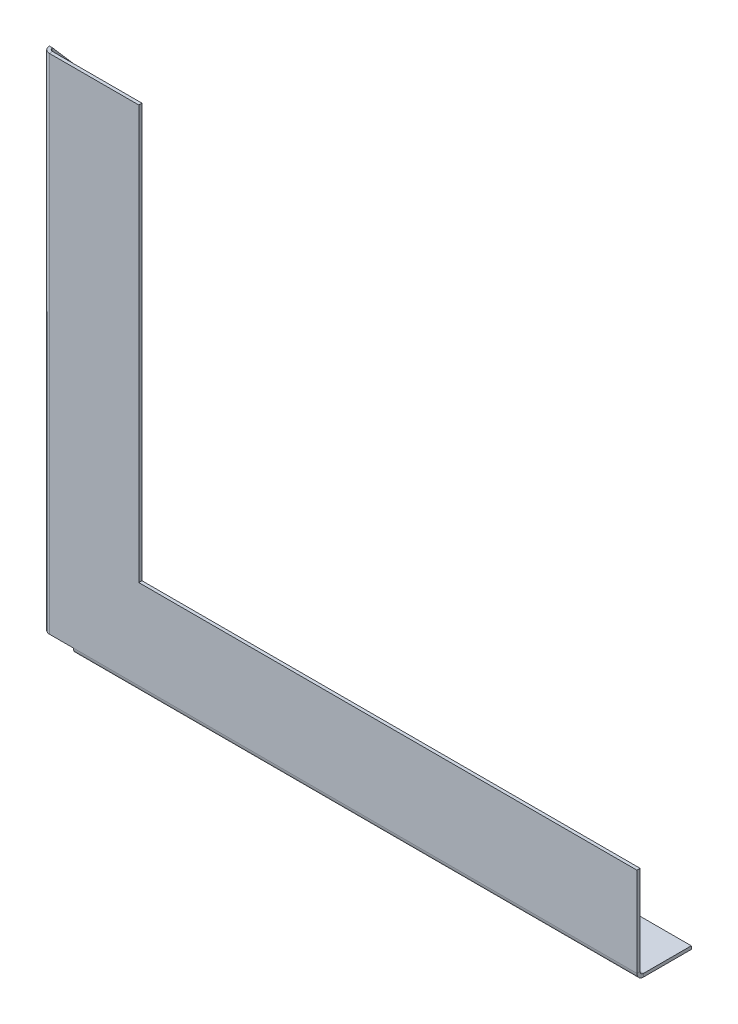
ISO-10303-21;
HEADER;
FILE_DESCRIPTION(('STEP AP214'),'2;1');
FILE_NAME('part.step','',(''),(''),'','','');
FILE_SCHEMA(('AUTOMOTIVE_DESIGN { 1 0 10303 214 1 1 1 1 }'));
ENDSEC;
DATA;
#1=APPLICATION_CONTEXT('core data for automotive mechanical design processes');
#2=APPLICATION_PROTOCOL_DEFINITION('international standard','automotive_design',2000,#1);
#3=PRODUCT_CONTEXT('',#1,'mechanical');
#4=PRODUCT('Part','Part','',(#3));
#5=PRODUCT_RELATED_PRODUCT_CATEGORY('part','',(#4));
#6=PRODUCT_DEFINITION_FORMATION('','',#4);
#7=PRODUCT_DEFINITION_CONTEXT('part definition',#1,'design');
#8=PRODUCT_DEFINITION('design','',#6,#7);
#9=PRODUCT_DEFINITION_SHAPE('','',#8);
#10=(LENGTH_UNIT() NAMED_UNIT(*) SI_UNIT(.MILLI.,.METRE.));
#11=(NAMED_UNIT(*) PLANE_ANGLE_UNIT() SI_UNIT($,.RADIAN.));
#12=(NAMED_UNIT(*) SI_UNIT($,.STERADIAN.) SOLID_ANGLE_UNIT());
#13=UNCERTAINTY_MEASURE_WITH_UNIT(LENGTH_MEASURE(1.E-05),#10,'distance_accuracy_value','');
#14=(GEOMETRIC_REPRESENTATION_CONTEXT(3) GLOBAL_UNCERTAINTY_ASSIGNED_CONTEXT((#13)) GLOBAL_UNIT_ASSIGNED_CONTEXT((#10,
#11,#12)) REPRESENTATION_CONTEXT('',''));
#15=CARTESIAN_POINT('',(0.,0.,0.));
#16=DIRECTION('',(0.,0.,1.));
#17=DIRECTION('',(1.,0.,0.));
#18=AXIS2_PLACEMENT_3D('',#15,#16,#17);
#19=CARTESIAN_POINT('',(-114.828433550695,43.3205731721392,2.));
#20=DIRECTION('',(0.,0.,-1.));
#21=DIRECTION('',(-1.,0.,0.));
#22=AXIS2_PLACEMENT_3D('',#19,#20,#21);
#23=PLANE('',#22);
#24=DIRECTION('',(0.,-1.,0.));
#25=VECTOR('',#24,1.);
#26=CARTESIAN_POINT('',(257.171566450635,-215.679426827861,2.));
#27=LINE('',#26,#25);
#28=CARTESIAN_POINT('',(257.171566450635,-215.679426827861,2.));
#29=VERTEX_POINT('',#28);
#30=CARTESIAN_POINT('',(257.171566449848,-271.679426685231,2.0000000950868));
#31=VERTEX_POINT('',#30);
#32=EDGE_CURVE('E283',#29,#31,#27,.T.);
#33=ORIENTED_EDGE('',*,*,#32,.F.);
#34=DIRECTION('',(-1.,0.,0.));
#35=VECTOR('',#34,1.);
#36=CARTESIAN_POINT('',(-54.8284335506954,-215.679426827861,2.));
#37=LINE('',#36,#35);
#38=CARTESIAN_POINT('',(-54.8284335506954,-215.679426827861,2.));
#39=VERTEX_POINT('',#38);
#40=EDGE_CURVE('E324',#29,#39,#37,.T.);
#41=ORIENTED_EDGE('',*,*,#40,.T.);
#42=DIRECTION('',(0.,1.,0.));
#43=VECTOR('',#42,1.);
#44=CARTESIAN_POINT('',(-54.8284335506954,43.3205731721392,2.));
#45=LINE('',#44,#43);
#46=CARTESIAN_POINT('',(-54.8284335506954,43.3205731721392,2.));
#47=VERTEX_POINT('',#46);
#48=EDGE_CURVE('E326',#39,#47,#45,.T.);
#49=ORIENTED_EDGE('',*,*,#48,.T.);
#50=DIRECTION('',(-1.,0.,0.));
#51=VECTOR('',#50,1.);
#52=CARTESIAN_POINT('',(-114.828433550695,43.3205731721392,2.));
#53=LINE('',#52,#51);
#54=CARTESIAN_POINT('',(-110.828433550695,43.3205731721392,2.00000000000001));
#55=VERTEX_POINT('',#54);
#56=EDGE_CURVE('E329',#47,#55,#53,.T.);
#57=ORIENTED_EDGE('',*,*,#56,.T.);
#58=DIRECTION('',(0.,-1.,0.));
#59=VECTOR('',#58,1.);
#60=CARTESIAN_POINT('',(-110.828433550695,43.3205731721392,2.00000000000001));
#61=LINE('',#60,#59);
#62=CARTESIAN_POINT('',(-110.828433550695,-271.679426685231,2.00000007757914));
#63=VERTEX_POINT('',#62);
#64=EDGE_CURVE('E343',#55,#63,#61,.T.);
#65=ORIENTED_EDGE('',*,*,#64,.T.);
#66=DIRECTION('',(1.,0.,0.));
#67=VECTOR('',#66,1.);
#68=CARTESIAN_POINT('',(-110.828433550695,-271.679426827861,1.99999999999994));
#69=LINE('',#68,#67);
#70=CARTESIAN_POINT('',(-95.8284335486283,-271.679426685231,2.00000019017365));
#71=VERTEX_POINT('',#70);
#72=EDGE_CURVE('E341',#63,#71,#69,.T.);
#73=ORIENTED_EDGE('',*,*,#72,.T.);
#74=DIRECTION('',(1.,0.,0.));
#75=VECTOR('',#74,1.);
#76=CARTESIAN_POINT('',(-110.828433550695,-271.679426827861,1.99999999999994));
#77=LINE('',#76,#75);
#78=EDGE_CURVE('E357',#71,#31,#77,.T.);
#79=ORIENTED_EDGE('',*,*,#78,.T.);
#80=EDGE_LOOP('',(#33,#41,#49,#57,#65,#73,#79));
#81=FACE_BOUND('',#80,.T.);
#82=ADVANCED_FACE('F84',(#81),#23,.F.);
#83=CARTESIAN_POINT('',(-114.828433550695,43.3205731721392,0.));
#84=DIRECTION('',(0.,0.,-1.));
#85=DIRECTION('',(-1.,0.,0.));
#86=AXIS2_PLACEMENT_3D('',#83,#84,#85);
#87=PLANE('',#86);
#88=DIRECTION('',(-1.,0.,0.));
#89=VECTOR('',#88,1.);
#90=CARTESIAN_POINT('',(-54.8284335506954,-215.679426827861,0.));
#91=LINE('',#90,#89);
#92=CARTESIAN_POINT('',(257.171566450635,-215.679426827861,0.));
#93=VERTEX_POINT('',#92);
#94=CARTESIAN_POINT('',(-54.8284335506954,-215.679426827861,0.));
#95=VERTEX_POINT('',#94);
#96=EDGE_CURVE('E323',#93,#95,#91,.T.);
#97=ORIENTED_EDGE('',*,*,#96,.F.);
#98=DIRECTION('',(0.,1.,0.));
#99=VECTOR('',#98,1.);
#100=CARTESIAN_POINT('',(257.171566450635,43.3205731721392,0.));
#101=LINE('',#100,#99);
#102=CARTESIAN_POINT('',(257.171566450635,-271.679426827861,0.));
#103=VERTEX_POINT('',#102);
#104=EDGE_CURVE('E310',#93,#103,#101,.F.);
#105=ORIENTED_EDGE('',*,*,#104,.T.);
#106=DIRECTION('',(1.,0.,0.));
#107=VECTOR('',#106,1.);
#108=CARTESIAN_POINT('',(-110.828433550695,-271.679426827861,0.));
#109=LINE('',#108,#107);
#110=CARTESIAN_POINT('',(-95.8284335486283,-271.679426756546,1.90173646361785E-07));
#111=VERTEX_POINT('',#110);
#112=EDGE_CURVE('E92',#111,#103,#109,.T.);
#113=ORIENTED_EDGE('',*,*,#112,.F.);
#114=DIRECTION('',(1.,0.,0.));
#115=VECTOR('',#114,1.);
#116=CARTESIAN_POINT('',(-110.828433550695,-271.679426827861,0.));
#117=LINE('',#116,#115);
#118=CARTESIAN_POINT('',(-110.828433548628,-271.679426685231,1.90173640723934E-07));
#119=VERTEX_POINT('',#118);
#120=EDGE_CURVE('E107',#119,#111,#117,.T.);
#121=ORIENTED_EDGE('',*,*,#120,.F.);
#122=DIRECTION('',(0.,-1.,0.));
#123=VECTOR('',#122,1.);
#124=CARTESIAN_POINT('',(-110.828433550695,43.3205731721392,0.));
#125=LINE('',#124,#123);
#126=CARTESIAN_POINT('',(-110.828433550695,43.3205731721392,0.));
#127=VERTEX_POINT('',#126);
#128=EDGE_CURVE('E351',#127,#119,#125,.T.);
#129=ORIENTED_EDGE('',*,*,#128,.F.);
#130=DIRECTION('',(-1.,0.,0.));
#131=VECTOR('',#130,1.);
#132=CARTESIAN_POINT('',(-114.828433550695,43.3205731721392,0.));
#133=LINE('',#132,#131);
#134=CARTESIAN_POINT('',(-54.8284335506954,43.3205731721392,0.));
#135=VERTEX_POINT('',#134);
#136=EDGE_CURVE('E327',#135,#127,#133,.T.);
#137=ORIENTED_EDGE('',*,*,#136,.F.);
#138=DIRECTION('',(0.,1.,0.));
#139=VECTOR('',#138,1.);
#140=CARTESIAN_POINT('',(-54.8284335506954,43.3205731721392,0.));
#141=LINE('',#140,#139);
#142=EDGE_CURVE('E333',#95,#135,#141,.T.);
#143=ORIENTED_EDGE('',*,*,#142,.F.);
#144=EDGE_LOOP('',(#97,#105,#113,#121,#129,#137,#143));
#145=FACE_BOUND('',#144,.T.);
#146=ADVANCED_FACE('F366',(#145),#87,.T.);
#147=CARTESIAN_POINT('',(-54.8284335506954,-215.679426827861,2.));
#148=DIRECTION('',(0.,-1.,0.));
#149=DIRECTION('',(1.,0.,0.));
#150=AXIS2_PLACEMENT_3D('',#147,#148,#149);
#151=PLANE('',#150);
#152=DIRECTION('',(0.,0.,1.));
#153=VECTOR('',#152,1.);
#154=CARTESIAN_POINT('',(257.171566450635,-215.679426827861,2.));
#155=LINE('',#154,#153);
#156=EDGE_CURVE('E318',#29,#93,#155,.F.);
#157=ORIENTED_EDGE('',*,*,#156,.T.);
#158=ORIENTED_EDGE('',*,*,#96,.T.);
#159=DIRECTION('',(0.,0.,-1.));
#160=VECTOR('',#159,1.);
#161=CARTESIAN_POINT('',(-54.8284335506954,-215.679426827861,2.));
#162=LINE('',#161,#160);
#163=EDGE_CURVE('E338',#39,#95,#162,.T.);
#164=ORIENTED_EDGE('',*,*,#163,.F.);
#165=ORIENTED_EDGE('',*,*,#40,.F.);
#166=EDGE_LOOP('',(#157,#158,#164,#165));
#167=FACE_BOUND('',#166,.T.);
#168=ADVANCED_FACE('F405',(#167),#151,.F.);
#169=CARTESIAN_POINT('',(-114.828433550695,43.3205731721392,2.));
#170=DIRECTION('',(0.,-1.,0.));
#171=DIRECTION('',(0.,0.,-1.));
#172=AXIS2_PLACEMENT_3D('',#169,#170,#171);
#173=PLANE('',#172);
#174=DIRECTION('',(0.,0.,1.));
#175=VECTOR('',#174,1.);
#176=CARTESIAN_POINT('',(-110.828433550695,43.3205731721392,0.));
#177=LINE('',#176,#175);
#178=EDGE_CURVE('E348',#127,#55,#177,.T.);
#179=ORIENTED_EDGE('',*,*,#178,.T.);
#180=ORIENTED_EDGE('',*,*,#56,.F.);
#181=DIRECTION('',(0.,0.,-1.));
#182=VECTOR('',#181,1.);
#183=CARTESIAN_POINT('',(-54.8284335506954,43.3205731721392,2.));
#184=LINE('',#183,#182);
#185=EDGE_CURVE('E331',#47,#135,#184,.T.);
#186=ORIENTED_EDGE('',*,*,#185,.T.);
#187=ORIENTED_EDGE('',*,*,#136,.T.);
#188=EDGE_LOOP('',(#179,#180,#186,#187));
#189=FACE_BOUND('',#188,.T.);
#190=ADVANCED_FACE('F409',(#189),#173,.F.);
#191=CARTESIAN_POINT('',(-54.8284335506954,43.3205731721392,2.));
#192=DIRECTION('',(-1.,0.,0.));
#193=DIRECTION('',(0.,-1.,0.));
#194=AXIS2_PLACEMENT_3D('',#191,#192,#193);
#195=PLANE('',#194);
#196=ORIENTED_EDGE('',*,*,#142,.T.);
#197=ORIENTED_EDGE('',*,*,#185,.F.);
#198=ORIENTED_EDGE('',*,*,#48,.F.);
#199=ORIENTED_EDGE('',*,*,#163,.T.);
#200=EDGE_LOOP('',(#196,#197,#198,#199));
#201=FACE_BOUND('',#200,.T.);
#202=ADVANCED_FACE('F412',(#201),#195,.F.);
#203=CARTESIAN_POINT('',(257.171566450635,-215.679426827861,2.));
#204=DIRECTION('',(1.,0.,0.));
#205=DIRECTION('',(0.,-1.,0.));
#206=AXIS2_PLACEMENT_3D('',#203,#204,#205);
#207=PLANE('',#206);
#208=ORIENTED_EDGE('',*,*,#32,.T.);
#209=DIRECTION('',(0.,0.,-1.));
#210=VECTOR('',#209,1.);
#211=CARTESIAN_POINT('',(257.171566450635,-271.679426827861,2.));
#212=LINE('',#211,#210);
#213=EDGE_CURVE('E13',#31,#103,#212,.T.);
#214=ORIENTED_EDGE('',*,*,#213,.T.);
#215=ORIENTED_EDGE('',*,*,#104,.F.);
#216=ORIENTED_EDGE('',*,*,#156,.F.);
#217=EDGE_LOOP('',(#208,#214,#215,#216));
#218=FACE_BOUND('',#217,.T.);
#219=ADVANCED_FACE('F369',(#218),#207,.T.);
#220=CARTESIAN_POINT('',(-110.828433550695,-271.679426827861,-2.00000007757913));
#221=DIRECTION('',(0.,-1.,0.));
#222=DIRECTION('',(0.,0.,-1.));
#223=AXIS2_PLACEMENT_3D('',#220,#221,#222);
#224=PLANE('',#223);
#225=DIRECTION('',(0.,0.,1.));
#226=VECTOR('',#225,1.);
#227=CARTESIAN_POINT('',(-110.828433548628,-271.679426685231,1.90173640723934E-07));
#228=LINE('',#227,#226);
#229=EDGE_CURVE('E354',#119,#63,#228,.T.);
#230=ORIENTED_EDGE('',*,*,#229,.F.);
#231=ORIENTED_EDGE('',*,*,#120,.T.);
#232=DIRECTION('',(0.,0.,1.));
#233=VECTOR('',#232,1.);
#234=CARTESIAN_POINT('',(-95.8284335486283,-271.679426685231,-32.0000001426302));
#235=LINE('',#234,#233);
#236=EDGE_CURVE('E360',#111,#71,#235,.T.);
#237=ORIENTED_EDGE('',*,*,#236,.T.);
#238=ORIENTED_EDGE('',*,*,#72,.F.);
#239=EDGE_LOOP('',(#230,#231,#237,#238));
#240=FACE_BOUND('',#239,.T.);
#241=ADVANCED_FACE('F86',(#240),#224,.T.);
#242=CARTESIAN_POINT('',(-110.828433550695,43.3205731721392,-2.00000007757913));
#243=DIRECTION('',(1.18077146293835E-10,1.,0.));
#244=DIRECTION('',(-1.,1.18077146293835E-10,0.));
#245=AXIS2_PLACEMENT_3D('',#242,#243,#244);
#246=PLANE('',#245);
#247=ORIENTED_EDGE('',*,*,#178,.F.);
#248=CARTESIAN_POINT('',(-110.828433550695,43.3205731721392,-2.00000007757913));
#249=DIRECTION('',(-1.18077146293835E-10,-1.,0.));
#250=DIRECTION('',(1.,-1.18077146293835E-10,0.));
#251=AXIS2_PLACEMENT_3D('',#248,#249,#250);
#252=CIRCLE('',#251,2.00000007757913);
#253=CARTESIAN_POINT('',(-112.828433434327,43.320573172878,-2.00000011636872));
#254=VERTEX_POINT('',#253);
#255=EDGE_CURVE('E243',#127,#254,#252,.T.);
#256=ORIENTED_EDGE('',*,*,#255,.T.);
#257=DIRECTION('',(-1.,0.,0.));
#258=VECTOR('',#257,1.);
#259=CARTESIAN_POINT('',(-112.828433434327,43.320573172878,-2.00000011636872));
#260=LINE('',#259,#258);
#261=CARTESIAN_POINT('',(-114.828433434327,43.320573172878,-2.00000011636872));
#262=VERTEX_POINT('',#261);
#263=EDGE_CURVE('E262',#254,#262,#260,.T.);
#264=ORIENTED_EDGE('',*,*,#263,.T.);
#265=CARTESIAN_POINT('',(-110.828433550695,43.3205731721392,-2.00000007757913));
#266=DIRECTION('',(-1.18077146293835E-10,-1.,0.));
#267=DIRECTION('',(1.,-1.18077146293835E-10,0.));
#268=AXIS2_PLACEMENT_3D('',#265,#266,#267);
#269=CIRCLE('',#268,4.0000001163687);
#270=EDGE_CURVE('E273',#55,#262,#269,.T.);
#271=ORIENTED_EDGE('',*,*,#270,.F.);
#272=EDGE_LOOP('',(#247,#256,#264,#271));
#273=FACE_BOUND('',#272,.T.);
#274=ADVANCED_FACE('F298',(#273),#246,.T.);
#275=CARTESIAN_POINT('',(-110.828433550695,-271.679426827861,-1.99999999999999));
#276=DIRECTION('',(0.,1.,0.));
#277=DIRECTION('',(0.,0.,1.));
#278=AXIS2_PLACEMENT_3D('',#275,#276,#277);
#279=PLANE('',#278);
#280=CARTESIAN_POINT('',(-112.828433628275,-271.679426827861,-1.99999992242085));
#281=CARTESIAN_POINT('',(-112.828434321183,-271.679426826375,-1.96727496543778));
#282=CARTESIAN_POINT('',(-112.827630459995,-271.679426824889,-1.93455006755361));
#283=CARTESIAN_POINT('',(-112.824418613813,-271.679426821918,-1.86917907739491));
#284=CARTESIAN_POINT('',(-112.822010628819,-271.679426820432,-1.83653298512038));
#285=CARTESIAN_POINT('',(-112.815595519414,-271.679426817461,-1.77139829359274));
#286=CARTESIAN_POINT('',(-112.811588395002,-271.679426815975,-1.73890969433964));
#287=CARTESIAN_POINT('',(-112.801984879095,-271.679426813003,-1.67416824598217));
#288=CARTESIAN_POINT('',(-112.796388487601,-271.679426811518,-1.64191539687781));
#289=CARTESIAN_POINT('',(-112.783619861094,-271.679426808546,-1.57772315163295));
#290=CARTESIAN_POINT('',(-112.77644762608,-271.679426807061,-1.54578375549247));
#291=CARTESIAN_POINT('',(-112.760544606787,-271.679426804089,-1.48229536020263));
#292=CARTESIAN_POINT('',(-112.751813822507,-271.679426802603,-1.45074636105327));
#293=CARTESIAN_POINT('',(-112.732814733694,-271.679426799632,-1.38811476425106));
#294=CARTESIAN_POINT('',(-112.722546429161,-271.679426798146,-1.3570321665982));
#295=CARTESIAN_POINT('',(-112.700497038213,-271.679426795175,-1.29540825343013));
#296=CARTESIAN_POINT('',(-112.688715951798,-271.679426793689,-1.26486693791492));
#297=CARTESIAN_POINT('',(-112.663669378453,-271.679426790718,-1.20439916573754));
#298=CARTESIAN_POINT('',(-112.650403891522,-271.679426789232,-1.17447270907537));
#299=CARTESIAN_POINT('',(-112.622420474943,-271.67942678626,-1.11530675005188));
#300=CARTESIAN_POINT('',(-112.607702545296,-271.679426784775,-1.08606724769057));
#301=CARTESIAN_POINT('',(-112.576849700042,-271.679426781803,-1.02834563778863));
#302=CARTESIAN_POINT('',(-112.560714784435,-271.679426780317,-0.999863530248017));
#303=CARTESIAN_POINT('',(-112.527066837693,-271.679426777346,-0.94372532587562));
#304=CARTESIAN_POINT('',(-112.509553806557,-271.67942677586,-0.916069229043841));
#305=CARTESIAN_POINT('',(-112.473191819178,-271.679426772889,-0.861649672045557));
#306=CARTESIAN_POINT('',(-112.454342862934,-271.679426771403,-0.834886211879053));
#307=CARTESIAN_POINT('',(-112.415354434125,-271.679426768432,-0.782316403727859));
#308=CARTESIAN_POINT('',(-112.395214961559,-271.679426766946,-0.75651005574317));
#309=CARTESIAN_POINT('',(-112.353694017855,-271.679426763974,-0.705916641705207));
#310=CARTESIAN_POINT('',(-112.332312546717,-271.679426762489,-0.681129575651933));
#311=CARTESIAN_POINT('',(-112.288359115703,-271.679426759517,-0.632634439687064));
#312=CARTESIAN_POINT('',(-112.265787155828,-271.679426758031,-0.608926369775469));
#313=CARTESIAN_POINT('',(-112.219507125166,-271.67942675506,-0.562646340908136));
#314=CARTESIAN_POINT('',(-112.195799054378,-271.679426753574,-0.540074381952398));
#315=CARTESIAN_POINT('',(-112.147303916709,-271.679426750603,-0.496120952820284));
#316=CARTESIAN_POINT('',(-112.122516849826,-271.679426749117,-0.474739482643908));
#317=CARTESIAN_POINT('',(-112.071923434177,-271.679426746146,-0.433218540902452));
#318=CARTESIAN_POINT('',(-112.046117085412,-271.67942674466,-0.413079069337372));
#319=CARTESIAN_POINT('',(-111.993547275748,-271.679426741688,-0.37409064256701));
#320=CARTESIAN_POINT('',(-111.96678381485,-271.679426740203,-0.355241687361728));
#321=CARTESIAN_POINT('',(-111.912364256442,-271.679426737231,-0.318879702093203));
#322=CARTESIAN_POINT('',(-111.884708158931,-271.679426735746,-0.301366672029961));
#323=CARTESIAN_POINT('',(-111.828569953253,-271.679426732774,-0.267718727465253));
#324=CARTESIAN_POINT('',(-111.800087845086,-271.679426731288,-0.251583812963787));
#325=CARTESIAN_POINT('',(-111.742366233988,-271.679426728317,-0.220730969948816));
#326=CARTESIAN_POINT('',(-111.713126731056,-271.679426726831,-0.20601304143531));
#327=CARTESIAN_POINT('',(-111.653960770947,-271.67942672386,-0.178029627151735));
#328=CARTESIAN_POINT('',(-111.62403431377,-271.679426722374,-0.164764141381665));
#329=CARTESIAN_POINT('',(-111.563566540621,-271.679426719402,-0.139717570381508));
#330=CARTESIAN_POINT('',(-111.533025224649,-271.679426717917,-0.127936485151421));
#331=CARTESIAN_POINT('',(-111.471401310625,-271.679426714945,-0.105887096593806));
#332=CARTESIAN_POINT('',(-111.440318712574,-271.67942671346,-0.0956187932662791));
#333=CARTESIAN_POINT('',(-111.377687115035,-271.679426710488,-0.0766197068826603));
#334=CARTESIAN_POINT('',(-111.346138115547,-271.679426709002,-0.0678889238265688));
#335=CARTESIAN_POINT('',(-111.28264971964,-271.679426706031,-0.051985906996194));
#336=CARTESIAN_POINT('',(-111.250710323222,-271.679426704545,-0.0448136732219106));
#337=CARTESIAN_POINT('',(-111.186518077481,-271.679426701574,-0.0320450492044796));
#338=CARTESIAN_POINT('',(-111.15426522816,-271.679426700088,-0.026448658961332));
#339=CARTESIAN_POINT('',(-111.08952377943,-271.679426697116,-0.0168451455662683));
#340=CARTESIAN_POINT('',(-111.057035180022,-271.679426695631,-0.012838022414352));
#341=CARTESIAN_POINT('',(-110.991900488245,-271.679426692659,-0.00642291553520229));
#342=CARTESIAN_POINT('',(-110.959254395877,-271.679426691173,-0.00401493180796915));
#343=CARTESIAN_POINT('',(-110.893883405594,-271.679426688202,-0.000803088162044626));
#344=CARTESIAN_POINT('',(-110.861158507678,-271.679426686716,7.71756646867352E-07));
#345=CARTESIAN_POINT('',(-110.828433550695,-271.679426685231,7.75791388595015E-08));
#346=B_SPLINE_CURVE_WITH_KNOTS('',3,(#280,#281,#282,#283,#284,#285,#286,#287,#288,#289,#290,
#291,#292,#293,#294,#295,#296,#297,#298,#299,#300,#301,#302,#303,#304,#305,#306,#307,#308,#309,
#310,#311,#312,#313,#314,#315,#316,#317,#318,#319,#320,#321,#322,#323,#324,#325,#326,#327,#328,
#329,#330,#331,#332,#333,#334,#335,#336,#337,#338,#339,#340,#341,#342,#343,#344,#345),
.UNSPECIFIED.,.F.,.F.,(4,2,2,2,2,2,2,2,2,2,2,2,2,2,2,2,2,2,2,2,2,2,2,2,2,2,2,2,2,2,2,2,4),(0.,
0.0981649154758065,0.196329830951611,0.294494746427416,0.392659661903222,0.490824577379027,
0.588989492854832,0.68715440833064,0.785319323806447,0.883484239282247,0.981649154758056,
1.07981407023386,1.17797898570966,1.27614390118547,1.37430881666128,1.47247373213708,
1.57063864761289,1.66880356308869,1.7669684785645,1.86513339404031,1.96329830951611,
2.06146322499192,2.15962814046773,2.25779305594353,2.35595797141933,2.45412288689513,
2.55228780237094,2.65045271784675,2.74861763332255,2.84678254879836,2.94494746427416,
3.04311237974997,3.14127729522578),.UNSPECIFIED.);
#347=CARTESIAN_POINT('',(-112.828433434327,-271.679426827122,-2.00000011636872));
#348=VERTEX_POINT('',#347);
#349=EDGE_CURVE('E277',#348,#119,#346,.T.);
#350=ORIENTED_EDGE('',*,*,#349,.T.);
#351=ORIENTED_EDGE('',*,*,#229,.T.);
#352=CARTESIAN_POINT('',(-114.828433628275,-271.679426827861,-1.99999984484171));
#353=CARTESIAN_POINT('',(-114.828435014091,-271.679426826375,-1.93454993214495));
#354=CARTESIAN_POINT('',(-114.826827291746,-271.679426824889,-1.86910013764601));
#355=CARTESIAN_POINT('',(-114.820403599507,-271.679426821918,-1.73835815986432));
#356=CARTESIAN_POINT('',(-114.815587629613,-271.679426820432,-1.67306597658158));
#357=CARTESIAN_POINT('',(-114.802757411051,-271.679426817461,-1.54279659605285));
#358=CARTESIAN_POINT('',(-114.794743162382,-271.679426815975,-1.47781939880687));
#359=CARTESIAN_POINT('',(-114.775536130942,-271.679426813003,-1.34833650460323));
#360=CARTESIAN_POINT('',(-114.76434334817,-271.679426811518,-1.28383080764556));
#361=CARTESIAN_POINT('',(-114.738806095651,-271.679426808546,-1.15544631964585));
#362=CARTESIAN_POINT('',(-114.724461625903,-271.679426807061,-1.0915675286038));
#363=CARTESIAN_POINT('',(-114.692655587933,-271.679426804089,-0.964590740486808));
#364=CARTESIAN_POINT('',(-114.675194019712,-271.679426802603,-0.901492743411866));
#365=CARTESIAN_POINT('',(-114.637195842823,-271.679426799632,-0.776229552236888));
#366=CARTESIAN_POINT('',(-114.616659234155,-271.679426798146,-0.714064358136853));
#367=CARTESIAN_POINT('',(-114.572560453114,-271.679426795175,-0.590816534191079));
#368=CARTESIAN_POINT('',(-114.548998280742,-271.679426793689,-0.52973390434534));
#369=CARTESIAN_POINT('',(-114.498905135022,-271.679426790718,-0.408798362336099));
#370=CARTESIAN_POINT('',(-114.472374161675,-271.679426789232,-0.348945450172596));
#371=CARTESIAN_POINT('',(-114.416407329603,-271.67942678626,-0.230613534420642));
#372=CARTESIAN_POINT('',(-114.386971470879,-271.679426784775,-0.172134530832191));
#373=CARTESIAN_POINT('',(-114.325265781567,-271.679426781803,-0.0566913132673186));
#374=CARTESIAN_POINT('',(-114.292995950981,-271.679426780317,0.000272900709102843));
#375=CARTESIAN_POINT('',(-114.225700058801,-271.679426777346,0.112549307276316));
#376=CARTESIAN_POINT('',(-114.190673997209,-271.67942677586,0.167861499867107));
#377=CARTESIAN_POINT('',(-114.11795002386,-271.679426772889,0.276700611752766));
#378=CARTESIAN_POINT('',(-114.080252112105,-271.679426771403,0.330227531047634));
#379=CARTESIAN_POINT('',(-114.002275255998,-271.679426768432,0.435367145310861));
#380=CARTESIAN_POINT('',(-113.961996311647,-271.679426766946,0.48697984027922));
#381=CARTESIAN_POINT('',(-113.87895442585,-271.679426763974,0.588166666392648));
#382=CARTESIAN_POINT('',(-113.836191484403,-271.679426762489,0.637740797537717));
#383=CARTESIAN_POINT('',(-113.748284624082,-271.679426759517,0.734731067586351));
#384=CARTESIAN_POINT('',(-113.703140705207,-271.679426758031,0.782147206489917));
#385=CARTESIAN_POINT('',(-113.610580645677,-271.67942675506,0.8747072624294));
#386=CARTESIAN_POINT('',(-113.563164505022,-271.679426753574,0.919851179465317));
#387=CARTESIAN_POINT('',(-113.466174231563,-271.679426750603,1.00775803602461));
#388=CARTESIAN_POINT('',(-113.41660009876,-271.679426749117,1.05052097554799));
#389=CARTESIAN_POINT('',(-113.315413269425,-271.679426746146,1.13356285742032));
#390=CARTESIAN_POINT('',(-113.263800572894,-271.67942674466,1.17384179976928));
#391=CARTESIAN_POINT('',(-113.158660955606,-271.679426741688,1.25181865179766));
#392=CARTESIAN_POINT('',(-113.105134034849,-271.679426740203,1.28951656147708));
#393=CARTESIAN_POINT('',(-112.996294920143,-271.679426737231,1.36224053060366));
#394=CARTESIAN_POINT('',(-112.940982726193,-271.679426735746,1.39726659005082));
#395=CARTESIAN_POINT('',(-112.828706317016,-271.679426732774,1.46456247787505));
#396=CARTESIAN_POINT('',(-112.771742101787,-271.679426731288,1.49683230625212));
#397=CARTESIAN_POINT('',(-112.656298881829,-271.679426728317,1.55853799108529));
#398=CARTESIAN_POINT('',(-112.597819877099,-271.679426726831,1.5879738475414));
#399=CARTESIAN_POINT('',(-112.479487959176,-271.67942672386,1.64394067502309));
#400=CARTESIAN_POINT('',(-112.419635045983,-271.679426722374,1.67047164604866));
#401=CARTESIAN_POINT('',(-112.298699502031,-271.679426719402,1.72056478707743));
#402=CARTESIAN_POINT('',(-112.237616871271,-271.679426717917,1.74412695708062));
#403=CARTESIAN_POINT('',(-112.114369045615,-271.679426714945,1.78822573334056));
#404=CARTESIAN_POINT('',(-112.052203850718,-271.67942671346,1.80876233959732));
#405=CARTESIAN_POINT('',(-111.926940658069,-271.679426710488,1.84676051162759));
#406=CARTESIAN_POINT('',(-111.863842660317,-271.679426709002,1.86422207740111));
#407=CARTESIAN_POINT('',(-111.736865870966,-271.679426706031,1.89602811044499));
#408=CARTESIAN_POINT('',(-111.672987079368,-271.679426704545,1.91037257771535));
#409=CARTESIAN_POINT('',(-111.544602590378,-271.679426701574,1.93590982525492));
#410=CARTESIAN_POINT('',(-111.480096892986,-271.679426700088,1.94710260552413));
#411=CARTESIAN_POINT('',(-111.350613998037,-271.679426697116,1.96630963194174));
#412=CARTESIAN_POINT('',(-111.28563680048,-271.679426695631,1.97432387809014));
#413=CARTESIAN_POINT('',(-111.155367419454,-271.679426692659,1.9871540915996));
#414=CARTESIAN_POINT('',(-111.090075235984,-271.679426691173,1.99197005896066));
#415=CARTESIAN_POINT('',(-110.959333257953,-271.679426688202,1.99839374612793));
#416=CARTESIAN_POINT('',(-110.893883463392,-271.679426686716,2.00000146593413));
#417=CARTESIAN_POINT('',(-110.828433550695,-271.679426685231,2.00000007757914));
#418=B_SPLINE_CURVE_WITH_KNOTS('',3,(#352,#353,#354,#355,#356,#357,#358,#359,#360,#361,#362,
#363,#364,#365,#366,#367,#368,#369,#370,#371,#372,#373,#374,#375,#376,#377,#378,#379,#380,#381,
#382,#383,#384,#385,#386,#387,#388,#389,#390,#391,#392,#393,#394,#395,#396,#397,#398,#399,#400,
#401,#402,#403,#404,#405,#406,#407,#408,#409,#410,#411,#412,#413,#414,#415,#416,#417),
.UNSPECIFIED.,.F.,.F.,(4,2,2,2,2,2,2,2,2,2,2,2,2,2,2,2,2,2,2,2,2,2,2,2,2,2,2,2,2,2,2,2,4),(0.,
0.196329827143838,0.392659654287674,0.588989481431507,0.785319308575348,0.981649135719183,
1.17797896286302,1.37430879000686,1.57063861715069,1.76696844429453,1.96329827143836,
2.1596280985822,2.35595792572604,2.55228775286987,2.74861758001371,2.94494740715754,
3.14127723430138,3.33760706144522,3.53393688858906,3.73026671573289,3.92659654287673,
4.12292637002057,4.3192561971644,4.51558602430824,4.71191585145208,4.90824567859591,
5.10457550573975,5.30090533288358,5.49723516002742,5.69356498717126,5.8898948143151,
6.08622464145893,6.28255446860276),.UNSPECIFIED.);
#419=CARTESIAN_POINT('',(-114.828433628275,-271.679426827861,-1.99999984484171));
#420=VERTEX_POINT('',#419);
#421=EDGE_CURVE('E276',#420,#63,#418,.T.);
#422=ORIENTED_EDGE('',*,*,#421,.F.);
#423=DIRECTION('',(0.999999999999998,-4.92550444874956E-10,-6.7881766180334E-08));
#424=VECTOR('',#423,1.);
#425=CARTESIAN_POINT('',(-114.828433434327,-271.679426826137,-1.9999999806052));
#426=LINE('',#425,#424);
#427=EDGE_CURVE('E268',#420,#348,#426,.T.);
#428=ORIENTED_EDGE('',*,*,#427,.T.);
#429=EDGE_LOOP('',(#350,#351,#422,#428));
#430=FACE_BOUND('',#429,.T.);
#431=ADVANCED_FACE('F296',(#430),#279,.F.);
#432=CARTESIAN_POINT('',(-110.828433550695,200.862168291453,-1.99999999999999));
#433=DIRECTION('',(0.,-1.,0.));
#434=DIRECTION('',(0.,0.,-1.));
#435=AXIS2_PLACEMENT_3D('',#432,#433,#434);
#436=CYLINDRICAL_SURFACE('',#435,4.00000007757913);
#437=DIRECTION('',(0.,-1.,0.));
#438=VECTOR('',#437,1.);
#439=CARTESIAN_POINT('',(-114.828433434327,-275.679426827122,-2.00000011636872));
#440=LINE('',#439,#438);
#441=EDGE_CURVE('E237',#262,#420,#440,.T.);
#442=ORIENTED_EDGE('',*,*,#441,.T.);
#443=ORIENTED_EDGE('',*,*,#421,.T.);
#444=ORIENTED_EDGE('',*,*,#64,.F.);
#445=ORIENTED_EDGE('',*,*,#270,.T.);
#446=EDGE_LOOP('',(#442,#443,#444,#445));
#447=FACE_BOUND('',#446,.T.);
#448=ADVANCED_FACE('F285',(#447),#436,.T.);
#449=CARTESIAN_POINT('',(-110.828433550695,200.862168291453,-1.99999999999999));
#450=DIRECTION('',(0.,-1.,0.));
#451=DIRECTION('',(0.,0.,-1.));
#452=AXIS2_PLACEMENT_3D('',#449,#450,#451);
#453=CYLINDRICAL_SURFACE('',#452,2.00000007757913);
#454=DIRECTION('',(0.,1.,0.));
#455=VECTOR('',#454,1.);
#456=CARTESIAN_POINT('',(-112.828433434327,-275.679426827122,-2.00000011636872));
#457=LINE('',#456,#455);
#458=EDGE_CURVE('E265',#348,#254,#457,.T.);
#459=ORIENTED_EDGE('',*,*,#458,.T.);
#460=ORIENTED_EDGE('',*,*,#255,.F.);
#461=ORIENTED_EDGE('',*,*,#128,.T.);
#462=ORIENTED_EDGE('',*,*,#349,.F.);
#463=EDGE_LOOP('',(#459,#460,#461,#462));
#464=FACE_BOUND('',#463,.T.);
#465=ADVANCED_FACE('F295',(#464),#453,.F.);
#466=CARTESIAN_POINT('',(-114.828433434327,-275.679426827122,-15.0000001163687));
#467=DIRECTION('',(0.,0.,1.));
#468=DIRECTION('',(1.,0.,0.));
#469=AXIS2_PLACEMENT_3D('',#466,#467,#468);
#470=PLANE('',#469);
#471=DIRECTION('',(0.,1.,0.));
#472=VECTOR('',#471,1.);
#473=CARTESIAN_POINT('',(-112.828433434327,-275.679426827122,-15.0000001163687));
#474=LINE('',#473,#472);
#475=CARTESIAN_POINT('',(-112.828433434327,28.3205731728779,-15.0000001163687));
#476=VERTEX_POINT('',#475);
#477=CARTESIAN_POINT('',(-112.828433434327,-271.679426826137,-15.0000001163687));
#478=VERTEX_POINT('',#477);
#479=EDGE_CURVE('E259',#476,#478,#474,.F.);
#480=ORIENTED_EDGE('',*,*,#479,.T.);
#481=DIRECTION('',(-1.,0.,0.));
#482=VECTOR('',#481,1.);
#483=CARTESIAN_POINT('',(-112.088433434327,-271.679426826137,-15.0000001163687));
#484=LINE('',#483,#482);
#485=CARTESIAN_POINT('',(-114.828433434327,-271.679426826137,-15.0000001163687));
#486=VERTEX_POINT('',#485);
#487=EDGE_CURVE('E256',#478,#486,#484,.T.);
#488=ORIENTED_EDGE('',*,*,#487,.T.);
#489=DIRECTION('',(0.,-1.,0.));
#490=VECTOR('',#489,1.);
#491=CARTESIAN_POINT('',(-114.828433434327,-275.679426827122,-15.0000001163687));
#492=LINE('',#491,#490);
#493=CARTESIAN_POINT('',(-114.828433434327,28.320573172878,-15.0000001163687));
#494=VERTEX_POINT('',#493);
#495=EDGE_CURVE('E250',#494,#486,#492,.T.);
#496=ORIENTED_EDGE('',*,*,#495,.F.);
#497=DIRECTION('',(-1.,0.,0.));
#498=VECTOR('',#497,1.);
#499=CARTESIAN_POINT('',(-114.828433434327,28.320573172878,-15.0000001163687));
#500=LINE('',#499,#498);
#501=EDGE_CURVE('E253',#494,#476,#500,.F.);
#502=ORIENTED_EDGE('',*,*,#501,.T.);
#503=EDGE_LOOP('',(#480,#488,#496,#502));
#504=FACE_BOUND('',#503,.T.);
#505=ADVANCED_FACE('F304',(#504),#470,.F.);
#506=CARTESIAN_POINT('',(-114.828433434327,-275.679426827122,-1.16368734093264E-07));
#507=DIRECTION('',(1.,0.,0.));
#508=DIRECTION('',(0.,0.,-1.));
#509=AXIS2_PLACEMENT_3D('',#506,#507,#508);
#510=PLANE('',#509);
#511=ORIENTED_EDGE('',*,*,#495,.T.);
#512=DIRECTION('',(0.,0.,-1.));
#513=VECTOR('',#512,1.);
#514=CARTESIAN_POINT('',(-114.828433434327,-271.679426826137,-1.9999999806052));
#515=LINE('',#514,#513);
#516=EDGE_CURVE('E244',#420,#486,#515,.T.);
#517=ORIENTED_EDGE('',*,*,#516,.F.);
#518=ORIENTED_EDGE('',*,*,#441,.F.);
#519=DIRECTION('',(0.,0.755689082789817,0.654930538417842));
#520=VECTOR('',#519,1.);
#521=CARTESIAN_POINT('',(-114.828433434327,28.320573172878,-15.0000001163687));
#522=LINE('',#521,#520);
#523=EDGE_CURVE('E248',#494,#262,#522,.T.);
#524=ORIENTED_EDGE('',*,*,#523,.F.);
#525=EDGE_LOOP('',(#511,#517,#518,#524));
#526=FACE_BOUND('',#525,.T.);
#527=ADVANCED_FACE('F446',(#526),#510,.F.);
#528=CARTESIAN_POINT('',(-114.828433434327,28.320573172878,-15.0000001163687));
#529=DIRECTION('',(0.,0.654930538417842,-0.755689082789817));
#530=DIRECTION('',(0.,0.755689082789817,0.654930538417842));
#531=AXIS2_PLACEMENT_3D('',#528,#529,#530);
#532=PLANE('',#531);
#533=ORIENTED_EDGE('',*,*,#501,.F.);
#534=ORIENTED_EDGE('',*,*,#523,.T.);
#535=ORIENTED_EDGE('',*,*,#263,.F.);
#536=DIRECTION('',(0.,0.755689082789817,0.654930538417842));
#537=VECTOR('',#536,1.);
#538=CARTESIAN_POINT('',(-112.828433434327,28.320573172878,-15.0000001163687));
#539=LINE('',#538,#537);
#540=EDGE_CURVE('E246',#476,#254,#539,.T.);
#541=ORIENTED_EDGE('',*,*,#540,.F.);
#542=EDGE_LOOP('',(#533,#534,#535,#541));
#543=FACE_BOUND('',#542,.T.);
#544=ADVANCED_FACE('F433',(#543),#532,.T.);
#545=CARTESIAN_POINT('',(-112.828433434327,-275.679426827122,-1.16368734093264E-07));
#546=DIRECTION('',(1.,0.,0.));
#547=DIRECTION('',(0.,0.,-1.));
#548=AXIS2_PLACEMENT_3D('',#545,#546,#547);
#549=PLANE('',#548);
#550=DIRECTION('',(0.,0.,1.));
#551=VECTOR('',#550,1.);
#552=CARTESIAN_POINT('',(-112.828433434327,-271.679426826137,-1.16368734093264E-07));
#553=LINE('',#552,#551);
#554=EDGE_CURVE('E241',#478,#348,#553,.T.);
#555=ORIENTED_EDGE('',*,*,#554,.F.);
#556=ORIENTED_EDGE('',*,*,#479,.F.);
#557=ORIENTED_EDGE('',*,*,#540,.T.);
#558=ORIENTED_EDGE('',*,*,#458,.F.);
#559=EDGE_LOOP('',(#555,#556,#557,#558));
#560=FACE_BOUND('',#559,.T.);
#561=ADVANCED_FACE('F440',(#560),#549,.T.);
#562=CARTESIAN_POINT('',(-110.828433492511,-271.679426826137,-2.00000013576346));
#563=DIRECTION('',(0.,-1.,0.));
#564=DIRECTION('',(0.,0.,-1.));
#565=AXIS2_PLACEMENT_3D('',#562,#563,#564);
#566=PLANE('',#565);
#567=ORIENTED_EDGE('',*,*,#427,.F.);
#568=ORIENTED_EDGE('',*,*,#516,.T.);
#569=ORIENTED_EDGE('',*,*,#487,.F.);
#570=ORIENTED_EDGE('',*,*,#554,.T.);
#571=EDGE_LOOP('',(#567,#568,#569,#570));
#572=FACE_BOUND('',#571,.T.);
#573=ADVANCED_FACE('F299',(#572),#566,.T.);
#574=CARTESIAN_POINT('',(257.171566449305,-271.679426827861,-2.00000019017377));
#575=DIRECTION('',(1.,0.,-1.35908472314854E-10));
#576=DIRECTION('',(-1.35908472314854E-10,0.,-1.));
#577=AXIS2_PLACEMENT_3D('',#574,#575,#576);
#578=PLANE('',#577);
#579=DIRECTION('',(0.,1.,0.));
#580=VECTOR('',#579,1.);
#581=CARTESIAN_POINT('',(257.171566451372,-275.679426685231,-1.99999995245664));
#582=LINE('',#581,#580);
#583=CARTESIAN_POINT('',(257.171566449305,-275.679426685231,-1.99999980982635));
#584=VERTEX_POINT('',#583);
#585=CARTESIAN_POINT('',(257.171566451372,-273.679426685231,-1.99999995245664));
#586=VERTEX_POINT('',#585);
#587=EDGE_CURVE('E227',#584,#586,#582,.T.);
#588=ORIENTED_EDGE('',*,*,#587,.T.);
#589=CARTESIAN_POINT('',(257.171566449305,-271.679426827861,-2.00000019017377));
#590=DIRECTION('',(-1.,0.,1.35908472314854E-10));
#591=DIRECTION('',(1.35908472314854E-10,0.,1.));
#592=AXIS2_PLACEMENT_3D('',#589,#590,#591);
#593=CIRCLE('',#592,2.00000019017371);
#594=EDGE_CURVE('E99',#586,#103,#593,.T.);
#595=ORIENTED_EDGE('',*,*,#594,.T.);
#596=ORIENTED_EDGE('',*,*,#213,.F.);
#597=CARTESIAN_POINT('',(257.171566449305,-271.679426827861,-2.00000019017377));
#598=DIRECTION('',(-1.,0.,1.35908472314854E-10));
#599=DIRECTION('',(1.35908472314854E-10,0.,1.));
#600=AXIS2_PLACEMENT_3D('',#597,#598,#599);
#601=CIRCLE('',#600,4.00000028526058);
#602=EDGE_CURVE('E230',#584,#31,#601,.T.);
#603=ORIENTED_EDGE('',*,*,#602,.F.);
#604=EDGE_LOOP('',(#588,#595,#596,#603));
#605=FACE_BOUND('',#604,.T.);
#606=ADVANCED_FACE('F372',(#605),#578,.T.);
#607=CARTESIAN_POINT('',(-95.8284335486283,-271.679426827861,-2.00000019017377));
#608=DIRECTION('',(-1.,0.,0.));
#609=DIRECTION('',(0.,0.,1.));
#610=AXIS2_PLACEMENT_3D('',#607,#608,#609);
#611=PLANE('',#610);
#612=ORIENTED_EDGE('',*,*,#236,.F.);
#613=CARTESIAN_POINT('',(-95.8284335486283,-271.679426827861,-2.00000000000006));
#614=DIRECTION('',(1.,0.,0.));
#615=DIRECTION('',(0.,0.,-1.));
#616=AXIS2_PLACEMENT_3D('',#613,#614,#615);
#617=CIRCLE('',#616,2.00000019017371);
#618=CARTESIAN_POINT('',(-95.8284335486283,-273.679426685231,-1.99999995245664));
#619=VERTEX_POINT('',#618);
#620=EDGE_CURVE('E234',#111,#619,#617,.T.);
#621=ORIENTED_EDGE('',*,*,#620,.T.);
#622=DIRECTION('',(0.,-0.999999999999997,7.13151204756454E-08));
#623=VECTOR('',#622,1.);
#624=CARTESIAN_POINT('',(-95.8284335486283,-273.679426685231,-1.99999995245664));
#625=LINE('',#624,#623);
#626=CARTESIAN_POINT('',(-95.8284335486283,-275.679427113121,-1.9999998098263));
#627=VERTEX_POINT('',#626);
#628=EDGE_CURVE('E220',#619,#627,#625,.T.);
#629=ORIENTED_EDGE('',*,*,#628,.T.);
#630=CARTESIAN_POINT('',(-95.8284335486283,-271.679426827861,-2.00000019017377));
#631=DIRECTION('',(1.,0.,0.));
#632=DIRECTION('',(0.,0.,-1.));
#633=AXIS2_PLACEMENT_3D('',#630,#631,#632);
#634=CIRCLE('',#633,4.00000028526058);
#635=EDGE_CURVE('E233',#71,#627,#634,.T.);
#636=ORIENTED_EDGE('',*,*,#635,.F.);
#637=EDGE_LOOP('',(#612,#621,#629,#636));
#638=FACE_BOUND('',#637,.T.);
#639=ADVANCED_FACE('F381',(#638),#611,.T.);
#640=CARTESIAN_POINT('',(-272.365551444802,-271.679426827861,-2.00000000000006));
#641=DIRECTION('',(1.,0.,0.));
#642=DIRECTION('',(0.,0.,-1.));
#643=AXIS2_PLACEMENT_3D('',#640,#641,#642);
#644=CYLINDRICAL_SURFACE('',#643,4.00000019017371);
#645=ORIENTED_EDGE('',*,*,#635,.T.);
#646=DIRECTION('',(1.,0.,0.));
#647=VECTOR('',#646,1.);
#648=CARTESIAN_POINT('',(282.171566451372,-275.679426685231,-1.99999995245664));
#649=LINE('',#648,#647);
#650=EDGE_CURVE('E210',#627,#584,#649,.T.);
#651=ORIENTED_EDGE('',*,*,#650,.T.);
#652=ORIENTED_EDGE('',*,*,#602,.T.);
#653=ORIENTED_EDGE('',*,*,#78,.F.);
#654=EDGE_LOOP('',(#645,#651,#652,#653));
#655=FACE_BOUND('',#654,.T.);
#656=ADVANCED_FACE('F374',(#655),#644,.T.);
#657=CARTESIAN_POINT('',(-272.365551444802,-271.679426827861,-2.00000000000006));
#658=DIRECTION('',(1.,0.,0.));
#659=DIRECTION('',(0.,0.,-1.));
#660=AXIS2_PLACEMENT_3D('',#657,#658,#659);
#661=CYLINDRICAL_SURFACE('',#660,2.00000019017371);
#662=ORIENTED_EDGE('',*,*,#620,.F.);
#663=ORIENTED_EDGE('',*,*,#112,.T.);
#664=ORIENTED_EDGE('',*,*,#594,.F.);
#665=DIRECTION('',(-1.,0.,0.));
#666=VECTOR('',#665,1.);
#667=CARTESIAN_POINT('',(282.171566451372,-273.679426685231,-1.99999995245664));
#668=LINE('',#667,#666);
#669=EDGE_CURVE('E224',#586,#619,#668,.T.);
#670=ORIENTED_EDGE('',*,*,#669,.T.);
#671=EDGE_LOOP('',(#662,#663,#664,#670));
#672=FACE_BOUND('',#671,.T.);
#673=ADVANCED_FACE('F364',(#672),#661,.F.);
#674=CARTESIAN_POINT('',(282.171566451372,-275.679426685231,-31.9999999524566));
#675=DIRECTION('',(0.,0.,1.));
#676=DIRECTION('',(0.,-1.,0.));
#677=AXIS2_PLACEMENT_3D('',#674,#675,#676);
#678=PLANE('',#677);
#679=DIRECTION('',(1.,0.,0.));
#680=VECTOR('',#679,1.);
#681=CARTESIAN_POINT('',(-110.828433548628,-275.679426685231,-31.9999999524566));
#682=LINE('',#681,#680);
#683=CARTESIAN_POINT('',(-95.8284335486283,-275.679426685231,-31.9999999524566));
#684=VERTEX_POINT('',#683);
#685=CARTESIAN_POINT('',(257.171566451372,-275.679426685231,-31.9999999524566));
#686=VERTEX_POINT('',#685);
#687=EDGE_CURVE('E207',#684,#686,#682,.T.);
#688=ORIENTED_EDGE('',*,*,#687,.F.);
#689=DIRECTION('',(0.,-1.,0.));
#690=VECTOR('',#689,1.);
#691=CARTESIAN_POINT('',(-95.8284335486283,-271.679426685231,-31.9999999524566));
#692=LINE('',#691,#690);
#693=CARTESIAN_POINT('',(-95.8284335486283,-273.679426685231,-31.9999999524566));
#694=VERTEX_POINT('',#693);
#695=EDGE_CURVE('E194',#694,#684,#692,.T.);
#696=ORIENTED_EDGE('',*,*,#695,.F.);
#697=DIRECTION('',(-1.,0.,0.));
#698=VECTOR('',#697,1.);
#699=CARTESIAN_POINT('',(282.171566451372,-273.679426685231,-31.9999999524566));
#700=LINE('',#699,#698);
#701=CARTESIAN_POINT('',(257.171566451372,-273.679426685231,-31.9999999524566));
#702=VERTEX_POINT('',#701);
#703=EDGE_CURVE('E217',#694,#702,#700,.F.);
#704=ORIENTED_EDGE('',*,*,#703,.T.);
#705=DIRECTION('',(0.,-1.,0.));
#706=VECTOR('',#705,1.);
#707=CARTESIAN_POINT('',(257.171566451372,-275.679426685231,-31.9999999524566));
#708=LINE('',#707,#706);
#709=EDGE_CURVE('E216',#686,#702,#708,.F.);
#710=ORIENTED_EDGE('',*,*,#709,.F.);
#711=EDGE_LOOP('',(#688,#696,#704,#710));
#712=FACE_BOUND('',#711,.T.);
#713=ADVANCED_FACE('F214',(#712),#678,.F.);
#714=CARTESIAN_POINT('',(-110.828433548628,-275.679426685231,4.75434136504305E-08));
#715=DIRECTION('',(0.,1.,0.));
#716=DIRECTION('',(0.,0.,1.));
#717=AXIS2_PLACEMENT_3D('',#714,#715,#716);
#718=PLANE('',#717);
#719=ORIENTED_EDGE('',*,*,#650,.F.);
#720=DIRECTION('',(0.,0.,1.));
#721=VECTOR('',#720,1.);
#722=CARTESIAN_POINT('',(-95.8284335486283,-275.679426685231,-31.9999999524566));
#723=LINE('',#722,#721);
#724=EDGE_CURVE('E198',#684,#627,#723,.T.);
#725=ORIENTED_EDGE('',*,*,#724,.F.);
#726=ORIENTED_EDGE('',*,*,#687,.T.);
#727=DIRECTION('',(0.,0.,-1.));
#728=VECTOR('',#727,1.);
#729=CARTESIAN_POINT('',(257.171566451372,-275.679426685231,-31.9999999524566));
#730=LINE('',#729,#728);
#731=EDGE_CURVE('E389',#584,#686,#730,.T.);
#732=ORIENTED_EDGE('',*,*,#731,.F.);
#733=EDGE_LOOP('',(#719,#725,#726,#732));
#734=FACE_BOUND('',#733,.T.);
#735=ADVANCED_FACE('F206',(#734),#718,.F.);
#736=CARTESIAN_POINT('',(-95.8284335486283,-271.679426685231,-31.9999999524566));
#737=DIRECTION('',(1.,0.,0.));
#738=DIRECTION('',(0.,1.,0.));
#739=AXIS2_PLACEMENT_3D('',#736,#737,#738);
#740=PLANE('',#739);
#741=ORIENTED_EDGE('',*,*,#628,.F.);
#742=DIRECTION('',(0.,0.,-1.));
#743=VECTOR('',#742,1.);
#744=CARTESIAN_POINT('',(-95.8284335486283,-273.679426685231,4.75433581392792E-08));
#745=LINE('',#744,#743);
#746=EDGE_CURVE('E200',#619,#694,#745,.T.);
#747=ORIENTED_EDGE('',*,*,#746,.T.);
#748=ORIENTED_EDGE('',*,*,#695,.T.);
#749=ORIENTED_EDGE('',*,*,#724,.T.);
#750=EDGE_LOOP('',(#741,#747,#748,#749));
#751=FACE_BOUND('',#750,.T.);
#752=ADVANCED_FACE('F197',(#751),#740,.F.);
#753=CARTESIAN_POINT('',(-110.828433548628,-273.679426685231,4.75433581392792E-08));
#754=DIRECTION('',(0.,1.,0.));
#755=DIRECTION('',(0.,0.,1.));
#756=AXIS2_PLACEMENT_3D('',#753,#754,#755);
#757=PLANE('',#756);
#758=ORIENTED_EDGE('',*,*,#746,.F.);
#759=ORIENTED_EDGE('',*,*,#669,.F.);
#760=DIRECTION('',(0.,0.,1.));
#761=VECTOR('',#760,1.);
#762=CARTESIAN_POINT('',(257.171566451372,-273.679426685231,4.75433581392792E-08));
#763=LINE('',#762,#761);
#764=EDGE_CURVE('E211',#586,#702,#763,.F.);
#765=ORIENTED_EDGE('',*,*,#764,.T.);
#766=ORIENTED_EDGE('',*,*,#703,.F.);
#767=EDGE_LOOP('',(#758,#759,#765,#766));
#768=FACE_BOUND('',#767,.T.);
#769=ADVANCED_FACE('F385',(#768),#757,.T.);
#770=CARTESIAN_POINT('',(257.171566451372,-275.679426685231,-31.9999999524566));
#771=DIRECTION('',(1.,0.,0.));
#772=DIRECTION('',(0.,0.,-1.));
#773=AXIS2_PLACEMENT_3D('',#770,#771,#772);
#774=PLANE('',#773);
#775=ORIENTED_EDGE('',*,*,#587,.F.);
#776=ORIENTED_EDGE('',*,*,#731,.T.);
#777=ORIENTED_EDGE('',*,*,#709,.T.);
#778=ORIENTED_EDGE('',*,*,#764,.F.);
#779=EDGE_LOOP('',(#775,#776,#777,#778));
#780=FACE_BOUND('',#779,.T.);
#781=ADVANCED_FACE('F388',(#780),#774,.T.);
#782=CLOSED_SHELL('',(#82,#146,#168,#190,#202,#219,#241,#274,#431,#448,#465,#505,#527,#544,#561,
#573,#606,#639,#656,#673,#713,#735,#752,#769,#781));
#783=MANIFOLD_SOLID_BREP('B2',#782);
#784=ADVANCED_BREP_SHAPE_REPRESENTATION('',(#18,#783),#14);
#785=SHAPE_DEFINITION_REPRESENTATION(#9,#784);
ENDSEC;
END-ISO-10303-21;
